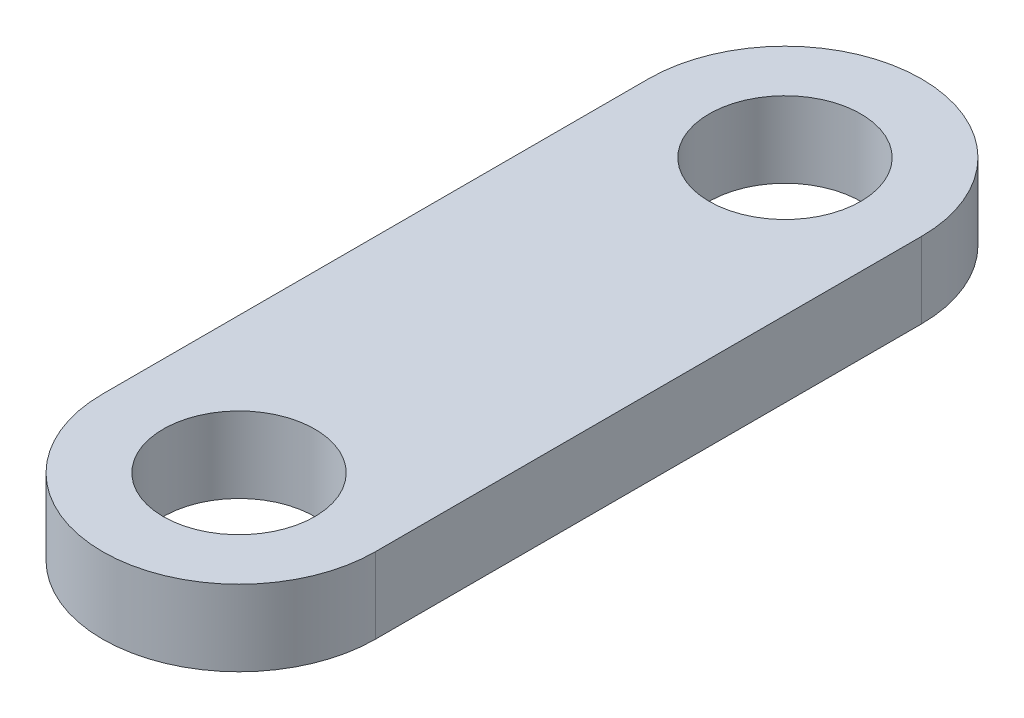
ISO-10303-21;
HEADER;
FILE_DESCRIPTION(('STEP AP214'),'2;1');
FILE_NAME('part.step','',(''),(''),'','','');
FILE_SCHEMA(('AUTOMOTIVE_DESIGN { 1 0 10303 214 1 1 1 1 }'));
ENDSEC;
DATA;
#1=APPLICATION_CONTEXT('core data for automotive mechanical design processes');
#2=APPLICATION_PROTOCOL_DEFINITION('international standard','automotive_design',2000,#1);
#3=PRODUCT_CONTEXT('',#1,'mechanical');
#4=PRODUCT('Part','Part','',(#3));
#5=PRODUCT_RELATED_PRODUCT_CATEGORY('part','',(#4));
#6=PRODUCT_DEFINITION_FORMATION('','',#4);
#7=PRODUCT_DEFINITION_CONTEXT('part definition',#1,'design');
#8=PRODUCT_DEFINITION('design','',#6,#7);
#9=PRODUCT_DEFINITION_SHAPE('','',#8);
#10=(LENGTH_UNIT() NAMED_UNIT(*) SI_UNIT(.MILLI.,.METRE.));
#11=(NAMED_UNIT(*) PLANE_ANGLE_UNIT() SI_UNIT($,.RADIAN.));
#12=(NAMED_UNIT(*) SI_UNIT($,.STERADIAN.) SOLID_ANGLE_UNIT());
#13=UNCERTAINTY_MEASURE_WITH_UNIT(LENGTH_MEASURE(1.E-05),#10,'distance_accuracy_value','');
#14=(GEOMETRIC_REPRESENTATION_CONTEXT(3) GLOBAL_UNCERTAINTY_ASSIGNED_CONTEXT((#13)) GLOBAL_UNIT_ASSIGNED_CONTEXT((#10,
#11,#12)) REPRESENTATION_CONTEXT('',''));
#15=CARTESIAN_POINT('',(0.,0.,0.));
#16=DIRECTION('',(0.,0.,1.));
#17=DIRECTION('',(1.,0.,0.));
#18=AXIS2_PLACEMENT_3D('',#15,#16,#17);
#19=CARTESIAN_POINT('',(0.,5.,0.));
#20=DIRECTION('',(0.,1.,0.));
#21=DIRECTION('',(0.,0.,1.));
#22=AXIS2_PLACEMENT_3D('',#19,#20,#21);
#23=PLANE('',#22);
#24=CARTESIAN_POINT('',(0.,5.,0.));
#25=DIRECTION('',(0.,1.,0.));
#26=DIRECTION('',(0.,0.,1.));
#27=AXIS2_PLACEMENT_3D('',#24,#25,#26);
#28=CIRCLE('',#27,5.);
#29=CARTESIAN_POINT('',(0.,5.,5.));
#30=VERTEX_POINT('',#29);
#31=EDGE_CURVE('E100',#30,#30,#28,.T.);
#32=ORIENTED_EDGE('',*,*,#31,.F.);
#33=EDGE_LOOP('',(#32));
#34=FACE_BOUND('',#33,.T.);
#35=CARTESIAN_POINT('',(0.,5.,0.));
#36=DIRECTION('',(0.,1.,0.));
#37=DIRECTION('',(0.,0.,1.));
#38=AXIS2_PLACEMENT_3D('',#35,#36,#37);
#39=CIRCLE('',#38,9.);
#40=CARTESIAN_POINT('',(9.,5.,0.));
#41=VERTEX_POINT('',#40);
#42=CARTESIAN_POINT('',(-9.,5.,0.));
#43=VERTEX_POINT('',#42);
#44=EDGE_CURVE('E85',#41,#43,#39,.T.);
#45=ORIENTED_EDGE('',*,*,#44,.T.);
#46=DIRECTION('',(0.,0.,1.));
#47=VECTOR('',#46,1.);
#48=CARTESIAN_POINT('',(-9.,5.,0.));
#49=LINE('',#48,#47);
#50=CARTESIAN_POINT('',(-9.,5.,36.));
#51=VERTEX_POINT('',#50);
#52=EDGE_CURVE('E80',#43,#51,#49,.T.);
#53=ORIENTED_EDGE('',*,*,#52,.T.);
#54=CARTESIAN_POINT('',(0.,5.,36.));
#55=DIRECTION('',(0.,1.,0.));
#56=DIRECTION('',(0.,0.,1.));
#57=AXIS2_PLACEMENT_3D('',#54,#55,#56);
#58=CIRCLE('',#57,9.);
#59=CARTESIAN_POINT('',(9.00000000000001,5.,36.));
#60=VERTEX_POINT('',#59);
#61=EDGE_CURVE('E83',#51,#60,#58,.T.);
#62=ORIENTED_EDGE('',*,*,#61,.T.);
#63=DIRECTION('',(0.,0.,-1.));
#64=VECTOR('',#63,1.);
#65=CARTESIAN_POINT('',(9.,5.,0.));
#66=LINE('',#65,#64);
#67=EDGE_CURVE('E50',#60,#41,#66,.T.);
#68=ORIENTED_EDGE('',*,*,#67,.T.);
#69=EDGE_LOOP('',(#45,#53,#62,#68));
#70=FACE_BOUND('',#69,.T.);
#71=CARTESIAN_POINT('',(0.,5.,36.));
#72=DIRECTION('',(0.,1.,0.));
#73=DIRECTION('',(0.,0.,1.));
#74=AXIS2_PLACEMENT_3D('',#71,#72,#73);
#75=CIRCLE('',#74,5.);
#76=CARTESIAN_POINT('',(0.,5.,41.));
#77=VERTEX_POINT('',#76);
#78=EDGE_CURVE('E115',#77,#77,#75,.T.);
#79=ORIENTED_EDGE('',*,*,#78,.F.);
#80=EDGE_LOOP('',(#79));
#81=FACE_BOUND('',#80,.T.);
#82=ADVANCED_FACE('F33',(#34,#70,#81),#23,.T.);
#83=CARTESIAN_POINT('',(0.,0.,0.));
#84=DIRECTION('',(0.,1.,0.));
#85=DIRECTION('',(0.,0.,1.));
#86=AXIS2_PLACEMENT_3D('',#83,#84,#85);
#87=PLANE('',#86);
#88=CARTESIAN_POINT('',(0.,0.,0.));
#89=DIRECTION('',(0.,1.,0.));
#90=DIRECTION('',(0.,0.,1.));
#91=AXIS2_PLACEMENT_3D('',#88,#89,#90);
#92=CIRCLE('',#91,9.);
#93=CARTESIAN_POINT('',(9.,0.,0.));
#94=VERTEX_POINT('',#93);
#95=CARTESIAN_POINT('',(-9.,0.,0.));
#96=VERTEX_POINT('',#95);
#97=EDGE_CURVE('E97',#94,#96,#92,.T.);
#98=ORIENTED_EDGE('',*,*,#97,.F.);
#99=DIRECTION('',(0.,0.,-1.));
#100=VECTOR('',#99,1.);
#101=CARTESIAN_POINT('',(9.,0.,0.));
#102=LINE('',#101,#100);
#103=CARTESIAN_POINT('',(9.00000000000001,0.,36.));
#104=VERTEX_POINT('',#103);
#105=EDGE_CURVE('E73',#104,#94,#102,.T.);
#106=ORIENTED_EDGE('',*,*,#105,.F.);
#107=CARTESIAN_POINT('',(0.,0.,36.));
#108=DIRECTION('',(0.,1.,0.));
#109=DIRECTION('',(0.,0.,1.));
#110=AXIS2_PLACEMENT_3D('',#107,#108,#109);
#111=CIRCLE('',#110,9.);
#112=CARTESIAN_POINT('',(-9.,0.,36.));
#113=VERTEX_POINT('',#112);
#114=EDGE_CURVE('E67',#113,#104,#111,.T.);
#115=ORIENTED_EDGE('',*,*,#114,.F.);
#116=DIRECTION('',(0.,0.,1.));
#117=VECTOR('',#116,1.);
#118=CARTESIAN_POINT('',(-9.,0.,0.));
#119=LINE('',#118,#117);
#120=EDGE_CURVE('E89',#96,#113,#119,.T.);
#121=ORIENTED_EDGE('',*,*,#120,.F.);
#122=EDGE_LOOP('',(#98,#106,#115,#121));
#123=FACE_BOUND('',#122,.T.);
#124=CARTESIAN_POINT('',(0.,0.,0.));
#125=DIRECTION('',(0.,1.,0.));
#126=DIRECTION('',(0.,0.,1.));
#127=AXIS2_PLACEMENT_3D('',#124,#125,#126);
#128=CIRCLE('',#127,5.);
#129=CARTESIAN_POINT('',(0.,0.,5.));
#130=VERTEX_POINT('',#129);
#131=EDGE_CURVE('E112',#130,#130,#128,.T.);
#132=ORIENTED_EDGE('',*,*,#131,.T.);
#133=EDGE_LOOP('',(#132));
#134=FACE_BOUND('',#133,.T.);
#135=CARTESIAN_POINT('',(0.,0.,36.));
#136=DIRECTION('',(0.,1.,0.));
#137=DIRECTION('',(0.,0.,1.));
#138=AXIS2_PLACEMENT_3D('',#135,#136,#137);
#139=CIRCLE('',#138,5.);
#140=CARTESIAN_POINT('',(0.,0.,41.));
#141=VERTEX_POINT('',#140);
#142=EDGE_CURVE('E118',#141,#141,#139,.T.);
#143=ORIENTED_EDGE('',*,*,#142,.T.);
#144=EDGE_LOOP('',(#143));
#145=FACE_BOUND('',#144,.T.);
#146=ADVANCED_FACE('F108',(#123,#134,#145),#87,.F.);
#147=CARTESIAN_POINT('',(0.,5.,0.));
#148=DIRECTION('',(0.,-1.,0.));
#149=DIRECTION('',(0.,0.,-1.));
#150=AXIS2_PLACEMENT_3D('',#147,#148,#149);
#151=CYLINDRICAL_SURFACE('',#150,9.);
#152=ORIENTED_EDGE('',*,*,#97,.T.);
#153=DIRECTION('',(0.,-1.,0.));
#154=VECTOR('',#153,1.);
#155=CARTESIAN_POINT('',(-9.,5.,0.));
#156=LINE('',#155,#154);
#157=EDGE_CURVE('E11',#43,#96,#156,.T.);
#158=ORIENTED_EDGE('',*,*,#157,.F.);
#159=ORIENTED_EDGE('',*,*,#44,.F.);
#160=DIRECTION('',(0.,-1.,0.));
#161=VECTOR('',#160,1.);
#162=CARTESIAN_POINT('',(9.,5.,0.));
#163=LINE('',#162,#161);
#164=EDGE_CURVE('E93',#41,#94,#163,.T.);
#165=ORIENTED_EDGE('',*,*,#164,.T.);
#166=EDGE_LOOP('',(#152,#158,#159,#165));
#167=FACE_BOUND('',#166,.T.);
#168=ADVANCED_FACE('F35',(#167),#151,.T.);
#169=CARTESIAN_POINT('',(-9.,5.,0.));
#170=DIRECTION('',(1.,0.,0.));
#171=DIRECTION('',(0.,0.,-1.));
#172=AXIS2_PLACEMENT_3D('',#169,#170,#171);
#173=PLANE('',#172);
#174=ORIENTED_EDGE('',*,*,#120,.T.);
#175=DIRECTION('',(0.,-1.,0.));
#176=VECTOR('',#175,1.);
#177=CARTESIAN_POINT('',(-9.,5.,36.));
#178=LINE('',#177,#176);
#179=EDGE_CURVE('E42',#51,#113,#178,.T.);
#180=ORIENTED_EDGE('',*,*,#179,.F.);
#181=ORIENTED_EDGE('',*,*,#52,.F.);
#182=ORIENTED_EDGE('',*,*,#157,.T.);
#183=EDGE_LOOP('',(#174,#180,#181,#182));
#184=FACE_BOUND('',#183,.T.);
#185=ADVANCED_FACE('F88',(#184),#173,.F.);
#186=CARTESIAN_POINT('',(0.,5.,36.));
#187=DIRECTION('',(0.,-1.,0.));
#188=DIRECTION('',(0.,0.,-1.));
#189=AXIS2_PLACEMENT_3D('',#186,#187,#188);
#190=CYLINDRICAL_SURFACE('',#189,9.);
#191=ORIENTED_EDGE('',*,*,#114,.T.);
#192=DIRECTION('',(0.,-1.,0.));
#193=VECTOR('',#192,1.);
#194=CARTESIAN_POINT('',(9.00000000000001,5.,36.));
#195=LINE('',#194,#193);
#196=EDGE_CURVE('E90',#60,#104,#195,.T.);
#197=ORIENTED_EDGE('',*,*,#196,.F.);
#198=ORIENTED_EDGE('',*,*,#61,.F.);
#199=ORIENTED_EDGE('',*,*,#179,.T.);
#200=EDGE_LOOP('',(#191,#197,#198,#199));
#201=FACE_BOUND('',#200,.T.);
#202=ADVANCED_FACE('F91',(#201),#190,.T.);
#203=CARTESIAN_POINT('',(9.,5.,0.));
#204=DIRECTION('',(-1.,0.,0.));
#205=DIRECTION('',(0.,0.,1.));
#206=AXIS2_PLACEMENT_3D('',#203,#204,#205);
#207=PLANE('',#206);
#208=ORIENTED_EDGE('',*,*,#105,.T.);
#209=ORIENTED_EDGE('',*,*,#164,.F.);
#210=ORIENTED_EDGE('',*,*,#67,.F.);
#211=ORIENTED_EDGE('',*,*,#196,.T.);
#212=EDGE_LOOP('',(#208,#209,#210,#211));
#213=FACE_BOUND('',#212,.T.);
#214=ADVANCED_FACE('F105',(#213),#207,.F.);
#215=CARTESIAN_POINT('',(0.,5.,0.));
#216=DIRECTION('',(0.,-1.,0.));
#217=DIRECTION('',(0.,0.,-1.));
#218=AXIS2_PLACEMENT_3D('',#215,#216,#217);
#219=CYLINDRICAL_SURFACE('',#218,5.);
#220=ORIENTED_EDGE('',*,*,#31,.T.);
#221=EDGE_LOOP('',(#220));
#222=FACE_BOUND('',#221,.T.);
#223=ORIENTED_EDGE('',*,*,#131,.F.);
#224=EDGE_LOOP('',(#223));
#225=FACE_BOUND('',#224,.T.);
#226=ADVANCED_FACE('F135',(#222,#225),#219,.F.);
#227=CARTESIAN_POINT('',(0.,5.,36.));
#228=DIRECTION('',(0.,-1.,0.));
#229=DIRECTION('',(0.,0.,-1.));
#230=AXIS2_PLACEMENT_3D('',#227,#228,#229);
#231=CYLINDRICAL_SURFACE('',#230,5.);
#232=ORIENTED_EDGE('',*,*,#78,.T.);
#233=EDGE_LOOP('',(#232));
#234=FACE_BOUND('',#233,.T.);
#235=ORIENTED_EDGE('',*,*,#142,.F.);
#236=EDGE_LOOP('',(#235));
#237=FACE_BOUND('',#236,.T.);
#238=ADVANCED_FACE('F124',(#234,#237),#231,.F.);
#239=CLOSED_SHELL('',(#82,#146,#168,#185,#202,#214,#226,#238));
#240=MANIFOLD_SOLID_BREP('B2',#239);
#241=ADVANCED_BREP_SHAPE_REPRESENTATION('',(#18,#240),#14);
#242=SHAPE_DEFINITION_REPRESENTATION(#9,#241);
ENDSEC;
END-ISO-10303-21;
